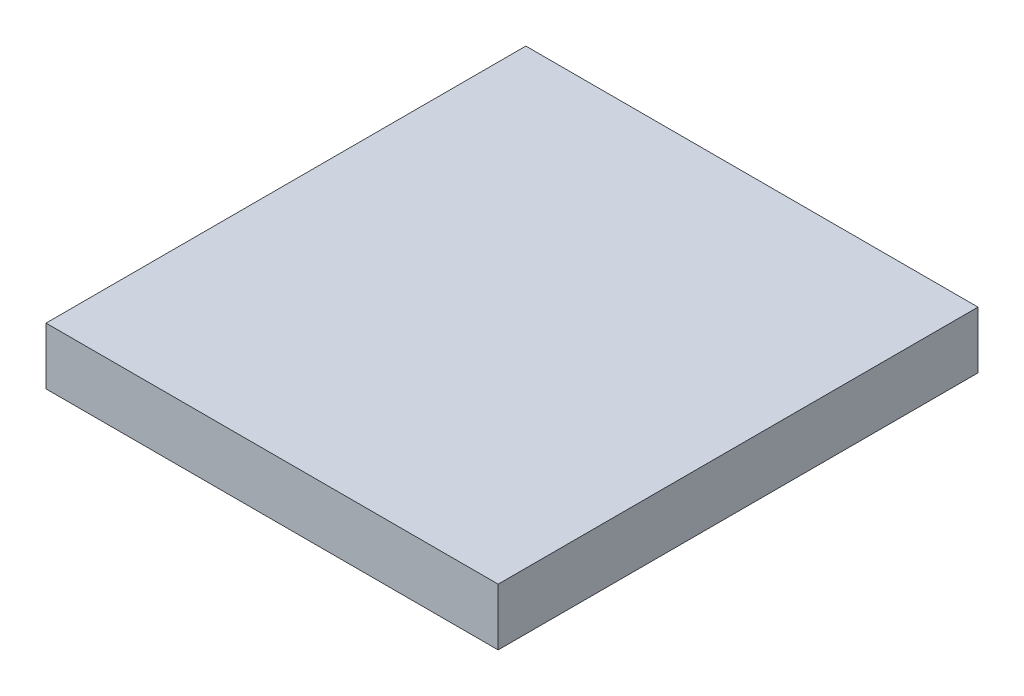
ISO-10303-21;
HEADER;
FILE_DESCRIPTION(('STEP AP214'),'2;1');
FILE_NAME('part.step','',(''),(''),'','','');
FILE_SCHEMA(('AUTOMOTIVE_DESIGN { 1 0 10303 214 1 1 1 1 }'));
ENDSEC;
DATA;
#1=APPLICATION_CONTEXT('core data for automotive mechanical design processes');
#2=APPLICATION_PROTOCOL_DEFINITION('international standard','automotive_design',2000,#1);
#3=PRODUCT_CONTEXT('',#1,'mechanical');
#4=PRODUCT('Part','Part','',(#3));
#5=PRODUCT_RELATED_PRODUCT_CATEGORY('part','',(#4));
#6=PRODUCT_DEFINITION_FORMATION('','',#4);
#7=PRODUCT_DEFINITION_CONTEXT('part definition',#1,'design');
#8=PRODUCT_DEFINITION('design','',#6,#7);
#9=PRODUCT_DEFINITION_SHAPE('','',#8);
#10=(LENGTH_UNIT() NAMED_UNIT(*) SI_UNIT(.MILLI.,.METRE.));
#11=(NAMED_UNIT(*) PLANE_ANGLE_UNIT() SI_UNIT($,.RADIAN.));
#12=(NAMED_UNIT(*) SI_UNIT($,.STERADIAN.) SOLID_ANGLE_UNIT());
#13=UNCERTAINTY_MEASURE_WITH_UNIT(LENGTH_MEASURE(1.E-05),#10,'distance_accuracy_value','');
#14=(GEOMETRIC_REPRESENTATION_CONTEXT(3) GLOBAL_UNCERTAINTY_ASSIGNED_CONTEXT((#13)) GLOBAL_UNIT_ASSIGNED_CONTEXT((#10,
#11,#12)) REPRESENTATION_CONTEXT('',''));
#15=CARTESIAN_POINT('',(0.,0.,0.));
#16=DIRECTION('',(0.,0.,1.));
#17=DIRECTION('',(1.,0.,0.));
#18=AXIS2_PLACEMENT_3D('',#15,#16,#17);
#19=CARTESIAN_POINT('',(0.,30.,0.));
#20=DIRECTION('',(1.,0.,0.));
#21=DIRECTION('',(0.,0.,-1.));
#22=AXIS2_PLACEMENT_3D('',#19,#20,#21);
#23=PLANE('',#22);
#24=DIRECTION('',(0.,0.,1.));
#25=VECTOR('',#24,1.);
#26=CARTESIAN_POINT('',(0.,0.,0.));
#27=LINE('',#26,#25);
#28=CARTESIAN_POINT('',(0.,0.,-252.580549317315));
#29=VERTEX_POINT('',#28);
#30=CARTESIAN_POINT('',(0.,0.,0.));
#31=VERTEX_POINT('',#30);
#32=EDGE_CURVE('E116',#29,#31,#27,.T.);
#33=ORIENTED_EDGE('',*,*,#32,.T.);
#34=DIRECTION('',(0.,-1.,0.));
#35=VECTOR('',#34,1.);
#36=CARTESIAN_POINT('',(0.,30.,0.));
#37=LINE('',#36,#35);
#38=CARTESIAN_POINT('',(0.,30.,0.));
#39=VERTEX_POINT('',#38);
#40=EDGE_CURVE('E11',#39,#31,#37,.T.);
#41=ORIENTED_EDGE('',*,*,#40,.F.);
#42=DIRECTION('',(0.,0.,1.));
#43=VECTOR('',#42,1.);
#44=CARTESIAN_POINT('',(0.,30.,0.));
#45=LINE('',#44,#43);
#46=CARTESIAN_POINT('',(0.,30.,-252.580549317315));
#47=VERTEX_POINT('',#46);
#48=EDGE_CURVE('E99',#47,#39,#45,.T.);
#49=ORIENTED_EDGE('',*,*,#48,.F.);
#50=DIRECTION('',(0.,-1.,0.));
#51=VECTOR('',#50,1.);
#52=CARTESIAN_POINT('',(0.,30.,-252.580549317315));
#53=LINE('',#52,#51);
#54=EDGE_CURVE('E112',#47,#29,#53,.T.);
#55=ORIENTED_EDGE('',*,*,#54,.T.);
#56=EDGE_LOOP('',(#33,#41,#49,#55));
#57=FACE_BOUND('',#56,.T.);
#58=ADVANCED_FACE('F41',(#57),#23,.F.);
#59=CARTESIAN_POINT('',(0.,30.,0.));
#60=DIRECTION('',(0.,0.,-1.));
#61=DIRECTION('',(-1.,0.,0.));
#62=AXIS2_PLACEMENT_3D('',#59,#60,#61);
#63=PLANE('',#62);
#64=DIRECTION('',(1.,0.,0.));
#65=VECTOR('',#64,1.);
#66=CARTESIAN_POINT('',(0.,0.,0.));
#67=LINE('',#66,#65);
#68=CARTESIAN_POINT('',(238.,0.,0.));
#69=VERTEX_POINT('',#68);
#70=EDGE_CURVE('E104',#31,#69,#67,.T.);
#71=ORIENTED_EDGE('',*,*,#70,.T.);
#72=DIRECTION('',(0.,-1.,0.));
#73=VECTOR('',#72,1.);
#74=CARTESIAN_POINT('',(238.,30.,0.));
#75=LINE('',#74,#73);
#76=CARTESIAN_POINT('',(238.,30.,0.));
#77=VERTEX_POINT('',#76);
#78=EDGE_CURVE('E50',#77,#69,#75,.T.);
#79=ORIENTED_EDGE('',*,*,#78,.F.);
#80=DIRECTION('',(1.,0.,0.));
#81=VECTOR('',#80,1.);
#82=CARTESIAN_POINT('',(0.,30.,0.));
#83=LINE('',#82,#81);
#84=EDGE_CURVE('E94',#39,#77,#83,.T.);
#85=ORIENTED_EDGE('',*,*,#84,.F.);
#86=ORIENTED_EDGE('',*,*,#40,.T.);
#87=EDGE_LOOP('',(#71,#79,#85,#86));
#88=FACE_BOUND('',#87,.T.);
#89=ADVANCED_FACE('F103',(#88),#63,.F.);
#90=CARTESIAN_POINT('',(238.,30.,0.));
#91=DIRECTION('',(-1.,0.,0.));
#92=DIRECTION('',(0.,0.,1.));
#93=AXIS2_PLACEMENT_3D('',#90,#91,#92);
#94=PLANE('',#93);
#95=DIRECTION('',(0.,0.,-1.));
#96=VECTOR('',#95,1.);
#97=CARTESIAN_POINT('',(238.,0.,0.));
#98=LINE('',#97,#96);
#99=CARTESIAN_POINT('',(238.,0.,-252.580549317315));
#100=VERTEX_POINT('',#99);
#101=EDGE_CURVE('E80',#69,#100,#98,.T.);
#102=ORIENTED_EDGE('',*,*,#101,.T.);
#103=DIRECTION('',(0.,-1.,0.));
#104=VECTOR('',#103,1.);
#105=CARTESIAN_POINT('',(238.,30.,-252.580549317315));
#106=LINE('',#105,#104);
#107=CARTESIAN_POINT('',(238.,30.,-252.580549317315));
#108=VERTEX_POINT('',#107);
#109=EDGE_CURVE('E106',#108,#100,#106,.T.);
#110=ORIENTED_EDGE('',*,*,#109,.F.);
#111=DIRECTION('',(0.,0.,-1.));
#112=VECTOR('',#111,1.);
#113=CARTESIAN_POINT('',(238.,30.,0.));
#114=LINE('',#113,#112);
#115=EDGE_CURVE('E97',#77,#108,#114,.T.);
#116=ORIENTED_EDGE('',*,*,#115,.F.);
#117=ORIENTED_EDGE('',*,*,#78,.T.);
#118=EDGE_LOOP('',(#102,#110,#116,#117));
#119=FACE_BOUND('',#118,.T.);
#120=ADVANCED_FACE('F107',(#119),#94,.F.);
#121=CARTESIAN_POINT('',(0.,30.,-252.580549317315));
#122=DIRECTION('',(0.,0.,1.));
#123=DIRECTION('',(1.,0.,0.));
#124=AXIS2_PLACEMENT_3D('',#121,#122,#123);
#125=PLANE('',#124);
#126=DIRECTION('',(-1.,0.,0.));
#127=VECTOR('',#126,1.);
#128=CARTESIAN_POINT('',(0.,0.,-252.580549317315));
#129=LINE('',#128,#127);
#130=EDGE_CURVE('E86',#100,#29,#129,.T.);
#131=ORIENTED_EDGE('',*,*,#130,.T.);
#132=ORIENTED_EDGE('',*,*,#54,.F.);
#133=DIRECTION('',(-1.,0.,0.));
#134=VECTOR('',#133,1.);
#135=CARTESIAN_POINT('',(0.,30.,-252.580549317315));
#136=LINE('',#135,#134);
#137=EDGE_CURVE('E61',#108,#47,#136,.T.);
#138=ORIENTED_EDGE('',*,*,#137,.F.);
#139=ORIENTED_EDGE('',*,*,#109,.T.);
#140=EDGE_LOOP('',(#131,#132,#138,#139));
#141=FACE_BOUND('',#140,.T.);
#142=ADVANCED_FACE('F128',(#141),#125,.F.);
#143=CARTESIAN_POINT('',(0.,30.,0.));
#144=DIRECTION('',(0.,-1.,0.));
#145=DIRECTION('',(0.,0.,-1.));
#146=AXIS2_PLACEMENT_3D('',#143,#144,#145);
#147=PLANE('',#146);
#148=ORIENTED_EDGE('',*,*,#48,.T.);
#149=ORIENTED_EDGE('',*,*,#84,.T.);
#150=ORIENTED_EDGE('',*,*,#115,.T.);
#151=ORIENTED_EDGE('',*,*,#137,.T.);
#152=EDGE_LOOP('',(#148,#149,#150,#151));
#153=FACE_BOUND('',#152,.T.);
#154=ADVANCED_FACE('F95',(#153),#147,.F.);
#155=CARTESIAN_POINT('',(0.,0.,0.));
#156=DIRECTION('',(0.,-1.,0.));
#157=DIRECTION('',(0.,0.,-1.));
#158=AXIS2_PLACEMENT_3D('',#155,#156,#157);
#159=PLANE('',#158);
#160=ORIENTED_EDGE('',*,*,#32,.F.);
#161=ORIENTED_EDGE('',*,*,#130,.F.);
#162=ORIENTED_EDGE('',*,*,#101,.F.);
#163=ORIENTED_EDGE('',*,*,#70,.F.);
#164=EDGE_LOOP('',(#160,#161,#162,#163));
#165=FACE_BOUND('',#164,.T.);
#166=ADVANCED_FACE('F131',(#165),#159,.T.);
#167=CLOSED_SHELL('',(#58,#89,#120,#142,#154,#166));
#168=MANIFOLD_SOLID_BREP('B2',#167);
#169=ADVANCED_BREP_SHAPE_REPRESENTATION('',(#18,#168),#14);
#170=SHAPE_DEFINITION_REPRESENTATION(#9,#169);
ENDSEC;
END-ISO-10303-21;
